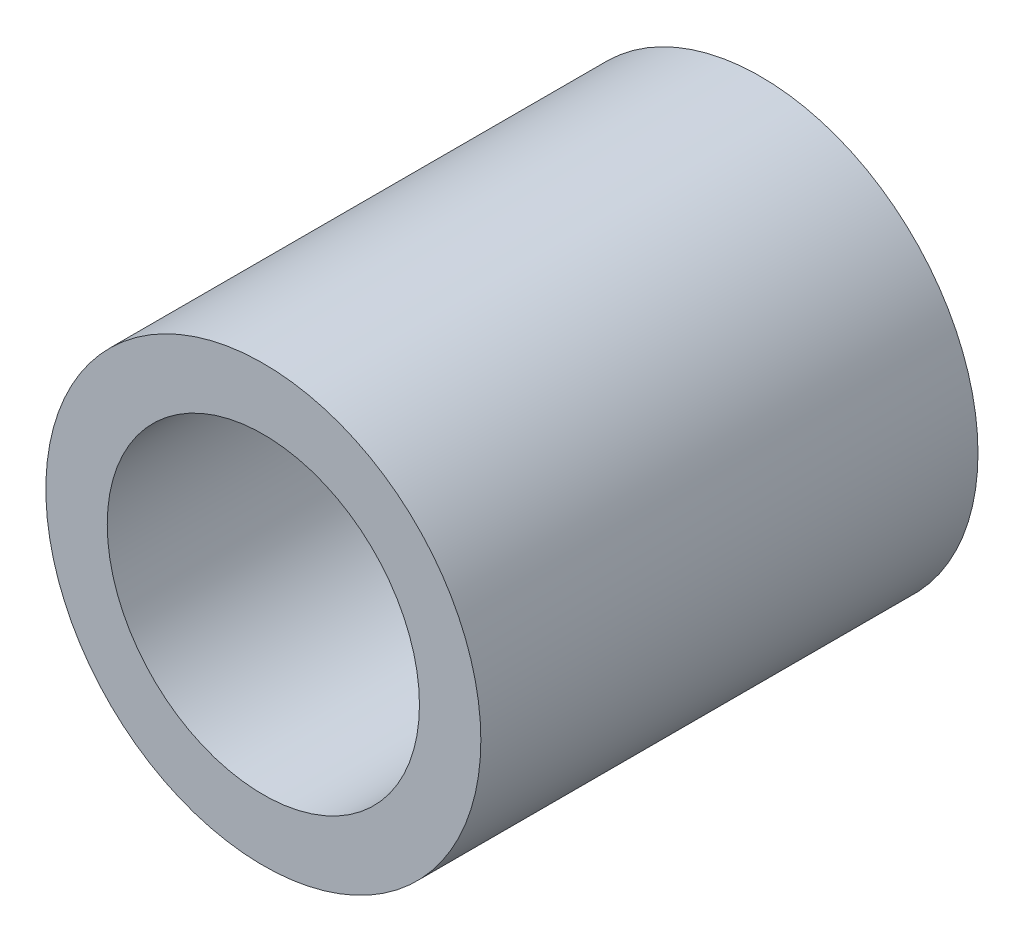
ISO-10303-21;
HEADER;
FILE_DESCRIPTION(('STEP AP214'),'2;1');
FILE_NAME('part.step','',(''),(''),'','','');
FILE_SCHEMA(('AUTOMOTIVE_DESIGN { 1 0 10303 214 1 1 1 1 }'));
ENDSEC;
DATA;
#1=APPLICATION_CONTEXT('core data for automotive mechanical design processes');
#2=APPLICATION_PROTOCOL_DEFINITION('international standard','automotive_design',2000,#1);
#3=PRODUCT_CONTEXT('',#1,'mechanical');
#4=PRODUCT('Part','Part','',(#3));
#5=PRODUCT_RELATED_PRODUCT_CATEGORY('part','',(#4));
#6=PRODUCT_DEFINITION_FORMATION('','',#4);
#7=PRODUCT_DEFINITION_CONTEXT('part definition',#1,'design');
#8=PRODUCT_DEFINITION('design','',#6,#7);
#9=PRODUCT_DEFINITION_SHAPE('','',#8);
#10=(LENGTH_UNIT() NAMED_UNIT(*) SI_UNIT(.MILLI.,.METRE.));
#11=(NAMED_UNIT(*) PLANE_ANGLE_UNIT() SI_UNIT($,.RADIAN.));
#12=(NAMED_UNIT(*) SI_UNIT($,.STERADIAN.) SOLID_ANGLE_UNIT());
#13=UNCERTAINTY_MEASURE_WITH_UNIT(LENGTH_MEASURE(1.E-05),#10,'distance_accuracy_value','');
#14=(GEOMETRIC_REPRESENTATION_CONTEXT(3) GLOBAL_UNCERTAINTY_ASSIGNED_CONTEXT((#13)) GLOBAL_UNIT_ASSIGNED_CONTEXT((#10,
#11,#12)) REPRESENTATION_CONTEXT('',''));
#15=CARTESIAN_POINT('',(0.,0.,0.));
#16=DIRECTION('',(0.,0.,1.));
#17=DIRECTION('',(1.,0.,0.));
#18=AXIS2_PLACEMENT_3D('',#15,#16,#17);
#19=CARTESIAN_POINT('',(0.,0.,6.35));
#20=DIRECTION('',(0.,0.,1.));
#21=DIRECTION('',(1.,0.,0.));
#22=AXIS2_PLACEMENT_3D('',#19,#20,#21);
#23=PLANE('',#22);
#24=CARTESIAN_POINT('',(0.,0.,6.35));
#25=DIRECTION('',(0.,0.,1.));
#26=DIRECTION('',(1.,0.,0.));
#27=AXIS2_PLACEMENT_3D('',#24,#25,#26);
#28=CIRCLE('',#27,5.55625);
#29=CARTESIAN_POINT('',(5.55625,0.,6.35));
#30=VERTEX_POINT('',#29);
#31=EDGE_CURVE('E10',#30,#30,#28,.T.);
#32=ORIENTED_EDGE('',*,*,#31,.T.);
#33=EDGE_LOOP('',(#32));
#34=FACE_BOUND('',#33,.T.);
#35=CARTESIAN_POINT('',(0.,0.,6.35));
#36=DIRECTION('',(0.,0.,1.));
#37=DIRECTION('',(1.,0.,0.));
#38=AXIS2_PLACEMENT_3D('',#35,#36,#37);
#39=CIRCLE('',#38,3.9878);
#40=CARTESIAN_POINT('',(3.9878,0.,6.35));
#41=VERTEX_POINT('',#40);
#42=EDGE_CURVE('E44',#41,#41,#39,.T.);
#43=ORIENTED_EDGE('',*,*,#42,.F.);
#44=EDGE_LOOP('',(#43));
#45=FACE_BOUND('',#44,.T.);
#46=ADVANCED_FACE('F33',(#34,#45),#23,.T.);
#47=CARTESIAN_POINT('',(0.,0.,-6.35));
#48=DIRECTION('',(0.,0.,1.));
#49=DIRECTION('',(1.,0.,0.));
#50=AXIS2_PLACEMENT_3D('',#47,#48,#49);
#51=PLANE('',#50);
#52=CARTESIAN_POINT('',(0.,0.,-6.35));
#53=DIRECTION('',(0.,0.,1.));
#54=DIRECTION('',(1.,0.,0.));
#55=AXIS2_PLACEMENT_3D('',#52,#53,#54);
#56=CIRCLE('',#55,5.55625);
#57=CARTESIAN_POINT('',(5.55625,0.,-6.35));
#58=VERTEX_POINT('',#57);
#59=EDGE_CURVE('E37',#58,#58,#56,.T.);
#60=ORIENTED_EDGE('',*,*,#59,.F.);
#61=EDGE_LOOP('',(#60));
#62=FACE_BOUND('',#61,.T.);
#63=CARTESIAN_POINT('',(0.,0.,-6.35));
#64=DIRECTION('',(0.,0.,1.));
#65=DIRECTION('',(1.,0.,0.));
#66=AXIS2_PLACEMENT_3D('',#63,#64,#65);
#67=CIRCLE('',#66,3.9878);
#68=CARTESIAN_POINT('',(3.9878,0.,-6.35));
#69=VERTEX_POINT('',#68);
#70=EDGE_CURVE('E46',#69,#69,#67,.T.);
#71=ORIENTED_EDGE('',*,*,#70,.T.);
#72=EDGE_LOOP('',(#71));
#73=FACE_BOUND('',#72,.T.);
#74=ADVANCED_FACE('F56',(#62,#73),#51,.F.);
#75=CARTESIAN_POINT('',(0.,0.,6.35));
#76=DIRECTION('',(0.,0.,-1.));
#77=DIRECTION('',(-1.,0.,0.));
#78=AXIS2_PLACEMENT_3D('',#75,#76,#77);
#79=CYLINDRICAL_SURFACE('',#78,5.55625);
#80=ORIENTED_EDGE('',*,*,#31,.F.);
#81=EDGE_LOOP('',(#80));
#82=FACE_BOUND('',#81,.T.);
#83=ORIENTED_EDGE('',*,*,#59,.T.);
#84=EDGE_LOOP('',(#83));
#85=FACE_BOUND('',#84,.T.);
#86=ADVANCED_FACE('F35',(#82,#85),#79,.T.);
#87=CARTESIAN_POINT('',(0.,0.,6.35));
#88=DIRECTION('',(0.,0.,-1.));
#89=DIRECTION('',(-1.,0.,0.));
#90=AXIS2_PLACEMENT_3D('',#87,#88,#89);
#91=CYLINDRICAL_SURFACE('',#90,3.9878);
#92=ORIENTED_EDGE('',*,*,#42,.T.);
#93=EDGE_LOOP('',(#92));
#94=FACE_BOUND('',#93,.T.);
#95=ORIENTED_EDGE('',*,*,#70,.F.);
#96=EDGE_LOOP('',(#95));
#97=FACE_BOUND('',#96,.T.);
#98=ADVANCED_FACE('F52',(#94,#97),#91,.F.);
#99=CLOSED_SHELL('',(#46,#74,#86,#98));
#100=MANIFOLD_SOLID_BREP('B2',#99);
#101=ADVANCED_BREP_SHAPE_REPRESENTATION('',(#18,#100),#14);
#102=SHAPE_DEFINITION_REPRESENTATION(#9,#101);
ENDSEC;
END-ISO-10303-21;
